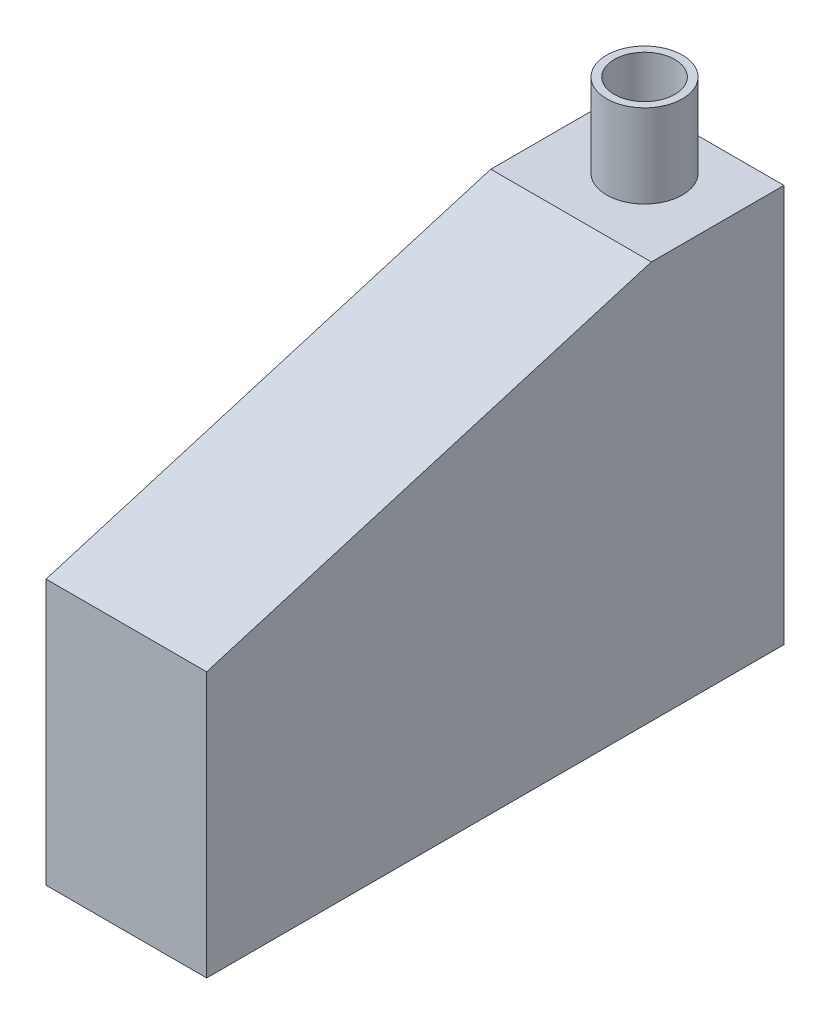
ISO-10303-21;
HEADER;
FILE_DESCRIPTION(('STEP AP214'),'2;1');
FILE_NAME('part.step','',(''),(''),'','','');
FILE_SCHEMA(('AUTOMOTIVE_DESIGN { 1 0 10303 214 1 1 1 1 }'));
ENDSEC;
DATA;
#1=APPLICATION_CONTEXT('core data for automotive mechanical design processes');
#2=APPLICATION_PROTOCOL_DEFINITION('international standard','automotive_design',2000,#1);
#3=PRODUCT_CONTEXT('',#1,'mechanical');
#4=PRODUCT('Part','Part','',(#3));
#5=PRODUCT_RELATED_PRODUCT_CATEGORY('part','',(#4));
#6=PRODUCT_DEFINITION_FORMATION('','',#4);
#7=PRODUCT_DEFINITION_CONTEXT('part definition',#1,'design');
#8=PRODUCT_DEFINITION('design','',#6,#7);
#9=PRODUCT_DEFINITION_SHAPE('','',#8);
#10=(LENGTH_UNIT() NAMED_UNIT(*) SI_UNIT(.MILLI.,.METRE.));
#11=(NAMED_UNIT(*) PLANE_ANGLE_UNIT() SI_UNIT($,.RADIAN.));
#12=(NAMED_UNIT(*) SI_UNIT($,.STERADIAN.) SOLID_ANGLE_UNIT());
#13=UNCERTAINTY_MEASURE_WITH_UNIT(LENGTH_MEASURE(1.E-05),#10,'distance_accuracy_value','');
#14=(GEOMETRIC_REPRESENTATION_CONTEXT(3) GLOBAL_UNCERTAINTY_ASSIGNED_CONTEXT((#13)) GLOBAL_UNIT_ASSIGNED_CONTEXT((#10,
#11,#12)) REPRESENTATION_CONTEXT('',''));
#15=CARTESIAN_POINT('',(0.,0.,0.));
#16=DIRECTION('',(0.,0.,1.));
#17=DIRECTION('',(1.,0.,0.));
#18=AXIS2_PLACEMENT_3D('',#15,#16,#17);
#19=CARTESIAN_POINT('',(0.,105.,0.));
#20=DIRECTION('',(0.,1.,0.));
#21=DIRECTION('',(0.,0.,1.));
#22=AXIS2_PLACEMENT_3D('',#19,#20,#21);
#23=PLANE('',#22);
#24=CARTESIAN_POINT('',(0.,105.,-60.5915110795934));
#25=DIRECTION('',(0.,1.,0.));
#26=DIRECTION('',(0.,0.,1.));
#27=AXIS2_PLACEMENT_3D('',#24,#25,#26);
#28=CIRCLE('',#27,8.);
#29=CARTESIAN_POINT('',(0.,105.,-52.5915110795934));
#30=VERTEX_POINT('',#29);
#31=EDGE_CURVE('E61',#30,#30,#28,.T.);
#32=ORIENTED_EDGE('',*,*,#31,.T.);
#33=EDGE_LOOP('',(#32));
#34=FACE_BOUND('',#33,.T.);
#35=CARTESIAN_POINT('',(0.,105.,-60.5915110795934));
#36=DIRECTION('',(0.,1.,0.));
#37=DIRECTION('',(0.,0.,1.));
#38=AXIS2_PLACEMENT_3D('',#35,#36,#37);
#39=CIRCLE('',#38,10.);
#40=CARTESIAN_POINT('',(0.,105.,-50.5915110795934));
#41=VERTEX_POINT('',#40);
#42=EDGE_CURVE('E51',#41,#41,#39,.T.);
#43=ORIENTED_EDGE('',*,*,#42,.F.);
#44=EDGE_LOOP('',(#43));
#45=FACE_BOUND('',#44,.T.);
#46=ADVANCED_FACE('F48',(#34,#45),#23,.F.);
#47=CARTESIAN_POINT('',(0.,127.,-60.5915110795934));
#48=DIRECTION('',(0.,-1.,0.));
#49=DIRECTION('',(0.,0.,-1.));
#50=AXIS2_PLACEMENT_3D('',#47,#48,#49);
#51=CYLINDRICAL_SURFACE('',#50,10.);
#52=CARTESIAN_POINT('',(0.,127.,-60.5915110795934));
#53=DIRECTION('',(0.,1.,0.));
#54=DIRECTION('',(0.,0.,1.));
#55=AXIS2_PLACEMENT_3D('',#52,#53,#54);
#56=CIRCLE('',#55,10.);
#57=CARTESIAN_POINT('',(0.,127.,-50.5915110795934));
#58=VERTEX_POINT('',#57);
#59=EDGE_CURVE('E55',#58,#58,#56,.T.);
#60=ORIENTED_EDGE('',*,*,#59,.F.);
#61=EDGE_LOOP('',(#60));
#62=FACE_BOUND('',#61,.T.);
#63=ORIENTED_EDGE('',*,*,#42,.T.);
#64=EDGE_LOOP('',(#63));
#65=FACE_BOUND('',#64,.T.);
#66=ADVANCED_FACE('F68',(#62,#65),#51,.T.);
#67=CARTESIAN_POINT('',(0.,127.,-60.5915110795934));
#68=DIRECTION('',(0.,1.,0.));
#69=DIRECTION('',(0.,0.,1.));
#70=AXIS2_PLACEMENT_3D('',#67,#68,#69);
#71=PLANE('',#70);
#72=ORIENTED_EDGE('',*,*,#59,.T.);
#73=EDGE_LOOP('',(#72));
#74=FACE_BOUND('',#73,.T.);
#75=CARTESIAN_POINT('',(0.,127.,-60.5915110795934));
#76=DIRECTION('',(0.,1.,0.));
#77=DIRECTION('',(0.,0.,1.));
#78=AXIS2_PLACEMENT_3D('',#75,#76,#77);
#79=CIRCLE('',#78,8.);
#80=CARTESIAN_POINT('',(0.,127.,-52.5915110795934));
#81=VERTEX_POINT('',#80);
#82=EDGE_CURVE('E11',#81,#81,#79,.T.);
#83=ORIENTED_EDGE('',*,*,#82,.F.);
#84=EDGE_LOOP('',(#83));
#85=FACE_BOUND('',#84,.T.);
#86=ADVANCED_FACE('F74',(#74,#85),#71,.T.);
#87=CARTESIAN_POINT('',(0.,127.,-60.5915110795934));
#88=DIRECTION('',(0.,-1.,0.));
#89=DIRECTION('',(0.,0.,-1.));
#90=AXIS2_PLACEMENT_3D('',#87,#88,#89);
#91=CYLINDRICAL_SURFACE('',#90,8.);
#92=ORIENTED_EDGE('',*,*,#82,.T.);
#93=EDGE_LOOP('',(#92));
#94=FACE_BOUND('',#93,.T.);
#95=ORIENTED_EDGE('',*,*,#31,.F.);
#96=EDGE_LOOP('',(#95));
#97=FACE_BOUND('',#96,.T.);
#98=ADVANCED_FACE('F80',(#94,#97),#91,.F.);
#99=CLOSED_SHELL('',(#46,#66,#86,#98));
#100=MANIFOLD_SOLID_BREP('B2',#99);
#101=CARTESIAN_POINT('',(177.567387904256,70.,-76.2));
#102=DIRECTION('',(0.,-1.,0.));
#103=DIRECTION('',(0.,0.,-1.));
#104=AXIS2_PLACEMENT_3D('',#101,#102,#103);
#105=PLANE('',#104);
#106=DIRECTION('',(-1.,0.,0.));
#107=VECTOR('',#106,1.);
#108=CARTESIAN_POINT('',(19.6,70.,71.9997886933622));
#109=LINE('',#108,#107);
#110=CARTESIAN_POINT('',(19.6,70.,71.9997886933622));
#111=VERTEX_POINT('',#110);
#112=CARTESIAN_POINT('',(-20.,70.,71.9997886933622));
#113=VERTEX_POINT('',#112);
#114=EDGE_CURVE('E247',#111,#113,#109,.T.);
#115=ORIENTED_EDGE('',*,*,#114,.F.);
#116=DIRECTION('',(0.,0.,-1.));
#117=VECTOR('',#116,1.);
#118=CARTESIAN_POINT('',(19.6,70.,0.));
#119=LINE('',#118,#117);
#120=CARTESIAN_POINT('',(19.6,70.,-75.));
#121=VERTEX_POINT('',#120);
#122=EDGE_CURVE('E274',#111,#121,#119,.T.);
#123=ORIENTED_EDGE('',*,*,#122,.T.);
#124=DIRECTION('',(-1.,0.,0.));
#125=VECTOR('',#124,1.);
#126=CARTESIAN_POINT('',(20.,70.,-75.));
#127=LINE('',#126,#125);
#128=CARTESIAN_POINT('',(20.,70.,-75.));
#129=VERTEX_POINT('',#128);
#130=EDGE_CURVE('E281',#129,#121,#127,.T.);
#131=ORIENTED_EDGE('',*,*,#130,.F.);
#132=DIRECTION('',(0.,0.,-1.));
#133=VECTOR('',#132,1.);
#134=CARTESIAN_POINT('',(20.,70.,75.));
#135=LINE('',#134,#133);
#136=CARTESIAN_POINT('',(20.,70.,75.));
#137=VERTEX_POINT('',#136);
#138=EDGE_CURVE('E301',#137,#129,#135,.T.);
#139=ORIENTED_EDGE('',*,*,#138,.F.);
#140=DIRECTION('',(1.,0.,0.));
#141=VECTOR('',#140,1.);
#142=CARTESIAN_POINT('',(20.,70.,75.));
#143=LINE('',#142,#141);
#144=CARTESIAN_POINT('',(-20.,70.,75.));
#145=VERTEX_POINT('',#144);
#146=EDGE_CURVE('E288',#145,#137,#143,.T.);
#147=ORIENTED_EDGE('',*,*,#146,.F.);
#148=DIRECTION('',(0.,0.,1.));
#149=VECTOR('',#148,1.);
#150=CARTESIAN_POINT('',(-20.,70.,75.));
#151=LINE('',#150,#149);
#152=EDGE_CURVE('E267',#113,#145,#151,.T.);
#153=ORIENTED_EDGE('',*,*,#152,.F.);
#154=EDGE_LOOP('',(#115,#123,#131,#139,#147,#153));
#155=FACE_BOUND('',#154,.T.);
#156=ADVANCED_FACE('F117',(#155),#105,.T.);
#157=CARTESIAN_POINT('',(0.,2.,0.));
#158=DIRECTION('',(0.,1.,0.));
#159=DIRECTION('',(0.,0.,1.));
#160=AXIS2_PLACEMENT_3D('',#157,#158,#159);
#161=PLANE('',#160);
#162=DIRECTION('',(0.,0.,-1.));
#163=VECTOR('',#162,1.);
#164=CARTESIAN_POINT('',(-20.,2.,0.));
#165=LINE('',#164,#163);
#166=CARTESIAN_POINT('',(-20.,2.,75.));
#167=VERTEX_POINT('',#166);
#168=CARTESIAN_POINT('',(-20.,2.,-75.));
#169=VERTEX_POINT('',#168);
#170=EDGE_CURVE('E240',#167,#169,#165,.T.);
#171=ORIENTED_EDGE('',*,*,#170,.F.);
#172=DIRECTION('',(-1.,0.,0.));
#173=VECTOR('',#172,1.);
#174=CARTESIAN_POINT('',(0.,2.,75.));
#175=LINE('',#174,#173);
#176=CARTESIAN_POINT('',(20.,2.,75.));
#177=VERTEX_POINT('',#176);
#178=EDGE_CURVE('E173',#177,#167,#175,.T.);
#179=ORIENTED_EDGE('',*,*,#178,.F.);
#180=DIRECTION('',(0.,0.,-1.));
#181=VECTOR('',#180,1.);
#182=CARTESIAN_POINT('',(20.,2.,0.));
#183=LINE('',#182,#181);
#184=CARTESIAN_POINT('',(20.,2.,-75.));
#185=VERTEX_POINT('',#184);
#186=EDGE_CURVE('E278',#177,#185,#183,.T.);
#187=ORIENTED_EDGE('',*,*,#186,.T.);
#188=DIRECTION('',(-1.,0.,0.));
#189=VECTOR('',#188,1.);
#190=CARTESIAN_POINT('',(0.,2.,-75.));
#191=LINE('',#190,#189);
#192=EDGE_CURVE('E309',#185,#169,#191,.T.);
#193=ORIENTED_EDGE('',*,*,#192,.T.);
#194=EDGE_LOOP('',(#171,#179,#187,#193));
#195=FACE_BOUND('',#194,.T.);
#196=ADVANCED_FACE('F327',(#195),#161,.T.);
#197=CARTESIAN_POINT('',(20.,70.,75.));
#198=DIRECTION('',(-1.,0.,0.));
#199=DIRECTION('',(0.,0.,1.));
#200=AXIS2_PLACEMENT_3D('',#197,#198,#199);
#201=PLANE('',#200);
#202=ORIENTED_EDGE('',*,*,#186,.F.);
#203=DIRECTION('',(0.,-1.,0.));
#204=VECTOR('',#203,1.);
#205=CARTESIAN_POINT('',(20.,70.,75.));
#206=LINE('',#205,#204);
#207=EDGE_CURVE('E284',#137,#177,#206,.T.);
#208=ORIENTED_EDGE('',*,*,#207,.F.);
#209=ORIENTED_EDGE('',*,*,#138,.T.);
#210=DIRECTION('',(0.,-1.,0.));
#211=VECTOR('',#210,1.);
#212=CARTESIAN_POINT('',(20.,70.,-75.));
#213=LINE('',#212,#211);
#214=EDGE_CURVE('E297',#129,#185,#213,.T.);
#215=ORIENTED_EDGE('',*,*,#214,.T.);
#216=EDGE_LOOP('',(#202,#208,#209,#215));
#217=FACE_BOUND('',#216,.T.);
#218=ADVANCED_FACE('F333',(#217),#201,.T.);
#219=CARTESIAN_POINT('',(20.,70.,-75.));
#220=DIRECTION('',(0.,0.,1.));
#221=DIRECTION('',(1.,0.,0.));
#222=AXIS2_PLACEMENT_3D('',#219,#220,#221);
#223=PLANE('',#222);
#224=ORIENTED_EDGE('',*,*,#192,.F.);
#225=ORIENTED_EDGE('',*,*,#214,.F.);
#226=ORIENTED_EDGE('',*,*,#130,.T.);
#227=DIRECTION('',(0.,1.,0.));
#228=VECTOR('',#227,1.);
#229=CARTESIAN_POINT('',(19.6,0.,-75.));
#230=LINE('',#229,#228);
#231=CARTESIAN_POINT('',(19.6,103.8,-75.));
#232=VERTEX_POINT('',#231);
#233=EDGE_CURVE('E260',#121,#232,#230,.T.);
#234=ORIENTED_EDGE('',*,*,#233,.T.);
#235=DIRECTION('',(-1.,0.,0.));
#236=VECTOR('',#235,1.);
#237=CARTESIAN_POINT('',(19.6,103.8,-75.));
#238=LINE('',#237,#236);
#239=CARTESIAN_POINT('',(-20.,103.8,-75.));
#240=VERTEX_POINT('',#239);
#241=EDGE_CURVE('E255',#232,#240,#238,.T.);
#242=ORIENTED_EDGE('',*,*,#241,.T.);
#243=DIRECTION('',(0.,-1.,0.));
#244=VECTOR('',#243,1.);
#245=CARTESIAN_POINT('',(-20.,70.,-75.));
#246=LINE('',#245,#244);
#247=EDGE_CURVE('E259',#240,#169,#246,.T.);
#248=ORIENTED_EDGE('',*,*,#247,.T.);
#249=EDGE_LOOP('',(#224,#225,#226,#234,#242,#248));
#250=FACE_BOUND('',#249,.T.);
#251=ADVANCED_FACE('F331',(#250),#223,.T.);
#252=CARTESIAN_POINT('',(-20.,70.,75.));
#253=DIRECTION('',(1.,0.,0.));
#254=DIRECTION('',(0.,0.,-1.));
#255=AXIS2_PLACEMENT_3D('',#252,#253,#254);
#256=PLANE('',#255);
#257=ORIENTED_EDGE('',*,*,#170,.T.);
#258=ORIENTED_EDGE('',*,*,#247,.F.);
#259=DIRECTION('',(0.,0.,1.));
#260=VECTOR('',#259,1.);
#261=CARTESIAN_POINT('',(-20.,103.8,0.));
#262=LINE('',#261,#260);
#263=CARTESIAN_POINT('',(-20.,103.8,-41.375068449495));
#264=VERTEX_POINT('',#263);
#265=EDGE_CURVE('E261',#240,#264,#262,.T.);
#266=ORIENTED_EDGE('',*,*,#265,.T.);
#267=DIRECTION('',(0.,-0.285699911836239,0.958319132844986));
#268=VECTOR('',#267,1.);
#269=CARTESIAN_POINT('',(-20.,83.9992331794369,25.0423608286226));
#270=LINE('',#269,#268);
#271=EDGE_CURVE('E264',#264,#113,#270,.T.);
#272=ORIENTED_EDGE('',*,*,#271,.T.);
#273=ORIENTED_EDGE('',*,*,#152,.T.);
#274=DIRECTION('',(0.,-1.,0.));
#275=VECTOR('',#274,1.);
#276=CARTESIAN_POINT('',(-20.,70.,75.));
#277=LINE('',#276,#275);
#278=EDGE_CURVE('E296',#145,#167,#277,.T.);
#279=ORIENTED_EDGE('',*,*,#278,.T.);
#280=EDGE_LOOP('',(#257,#258,#266,#272,#273,#279));
#281=FACE_BOUND('',#280,.T.);
#282=ADVANCED_FACE('F323',(#281),#256,.T.);
#283=CARTESIAN_POINT('',(20.,70.,75.));
#284=DIRECTION('',(0.,0.,-1.));
#285=DIRECTION('',(-1.,0.,0.));
#286=AXIS2_PLACEMENT_3D('',#283,#284,#285);
#287=PLANE('',#286);
#288=ORIENTED_EDGE('',*,*,#178,.T.);
#289=ORIENTED_EDGE('',*,*,#278,.F.);
#290=ORIENTED_EDGE('',*,*,#146,.T.);
#291=ORIENTED_EDGE('',*,*,#207,.T.);
#292=EDGE_LOOP('',(#288,#289,#290,#291));
#293=FACE_BOUND('',#292,.T.);
#294=ADVANCED_FACE('F336',(#293),#287,.T.);
#295=CARTESIAN_POINT('',(19.6,103.8,0.));
#296=DIRECTION('',(0.,-1.,0.));
#297=DIRECTION('',(0.,0.,-1.));
#298=AXIS2_PLACEMENT_3D('',#295,#296,#297);
#299=PLANE('',#298);
#300=CARTESIAN_POINT('',(0.,103.8,-60.5915110795934));
#301=DIRECTION('',(0.,-1.,0.));
#302=DIRECTION('',(0.,0.,-1.));
#303=AXIS2_PLACEMENT_3D('',#300,#301,#302);
#304=CIRCLE('',#303,10.);
#305=CARTESIAN_POINT('',(0.,103.8,-70.5915110795934));
#306=VERTEX_POINT('',#305);
#307=EDGE_CURVE('E270',#306,#306,#304,.F.);
#308=ORIENTED_EDGE('',*,*,#307,.T.);
#309=EDGE_LOOP('',(#308));
#310=FACE_BOUND('',#309,.T.);
#311=ORIENTED_EDGE('',*,*,#265,.F.);
#312=ORIENTED_EDGE('',*,*,#241,.F.);
#313=DIRECTION('',(0.,0.,1.));
#314=VECTOR('',#313,1.);
#315=CARTESIAN_POINT('',(19.6,103.8,0.));
#316=LINE('',#315,#314);
#317=CARTESIAN_POINT('',(19.6,103.8,-41.375068449495));
#318=VERTEX_POINT('',#317);
#319=EDGE_CURVE('E164',#232,#318,#316,.T.);
#320=ORIENTED_EDGE('',*,*,#319,.T.);
#321=DIRECTION('',(-1.,0.,0.));
#322=VECTOR('',#321,1.);
#323=CARTESIAN_POINT('',(19.6,103.8,-41.375068449495));
#324=LINE('',#323,#322);
#325=EDGE_CURVE('E252',#318,#264,#324,.T.);
#326=ORIENTED_EDGE('',*,*,#325,.T.);
#327=EDGE_LOOP('',(#311,#312,#320,#326));
#328=FACE_BOUND('',#327,.T.);
#329=ADVANCED_FACE('F338',(#310,#328),#299,.T.);
#330=CARTESIAN_POINT('',(19.6,83.9992331794369,25.0423608286226));
#331=DIRECTION('',(0.,-0.958319132844986,-0.285699911836239));
#332=DIRECTION('',(0.,0.285699911836239,-0.958319132844986));
#333=AXIS2_PLACEMENT_3D('',#330,#331,#332);
#334=PLANE('',#333);
#335=ORIENTED_EDGE('',*,*,#271,.F.);
#336=ORIENTED_EDGE('',*,*,#325,.F.);
#337=DIRECTION('',(0.,-0.285699911836239,0.958319132844986));
#338=VECTOR('',#337,1.);
#339=CARTESIAN_POINT('',(19.6,83.9992331794369,25.0423608286226));
#340=LINE('',#339,#338);
#341=EDGE_CURVE('E251',#318,#111,#340,.T.);
#342=ORIENTED_EDGE('',*,*,#341,.T.);
#343=ORIENTED_EDGE('',*,*,#114,.T.);
#344=EDGE_LOOP('',(#335,#336,#342,#343));
#345=FACE_BOUND('',#344,.T.);
#346=ADVANCED_FACE('F344',(#345),#334,.T.);
#347=CARTESIAN_POINT('',(19.6,0.,0.));
#348=DIRECTION('',(-1.,0.,0.));
#349=DIRECTION('',(0.,0.,1.));
#350=AXIS2_PLACEMENT_3D('',#347,#348,#349);
#351=PLANE('',#350);
#352=ORIENTED_EDGE('',*,*,#233,.F.);
#353=ORIENTED_EDGE('',*,*,#122,.F.);
#354=ORIENTED_EDGE('',*,*,#341,.F.);
#355=ORIENTED_EDGE('',*,*,#319,.F.);
#356=EDGE_LOOP('',(#352,#353,#354,#355));
#357=FACE_BOUND('',#356,.T.);
#358=ADVANCED_FACE('F360',(#357),#351,.T.);
#359=CARTESIAN_POINT('',(0.,-0.001000000000001,-60.5915110795934));
#360=DIRECTION('',(0.,1.,0.));
#361=DIRECTION('',(0.,0.,1.));
#362=AXIS2_PLACEMENT_3D('',#359,#360,#361);
#363=CYLINDRICAL_SURFACE('',#362,10.);
#364=ORIENTED_EDGE('',*,*,#307,.F.);
#365=EDGE_LOOP('',(#364));
#366=FACE_BOUND('',#365,.T.);
#367=CARTESIAN_POINT('',(0.,105.,-60.5915110795934));
#368=DIRECTION('',(0.,1.,0.));
#369=DIRECTION('',(0.,0.,1.));
#370=AXIS2_PLACEMENT_3D('',#367,#368,#369);
#371=CIRCLE('',#370,10.);
#372=CARTESIAN_POINT('',(0.,105.,-50.5915110795934));
#373=VERTEX_POINT('',#372);
#374=EDGE_CURVE('E121',#373,#373,#371,.T.);
#375=ORIENTED_EDGE('',*,*,#374,.T.);
#376=EDGE_LOOP('',(#375));
#377=FACE_BOUND('',#376,.T.);
#378=ADVANCED_FACE('F364',(#366,#377),#363,.F.);
#379=CARTESIAN_POINT('',(0.,0.,0.));
#380=DIRECTION('',(0.,1.,0.));
#381=DIRECTION('',(0.,0.,1.));
#382=AXIS2_PLACEMENT_3D('',#379,#380,#381);
#383=PLANE('',#382);
#384=DIRECTION('',(0.,0.,1.));
#385=VECTOR('',#384,1.);
#386=CARTESIAN_POINT('',(-21.2,0.,76.2));
#387=LINE('',#386,#385);
#388=CARTESIAN_POINT('',(-21.2,0.,-76.2));
#389=VERTEX_POINT('',#388);
#390=CARTESIAN_POINT('',(-21.2,0.,76.2));
#391=VERTEX_POINT('',#390);
#392=EDGE_CURVE('E380',#389,#391,#387,.T.);
#393=ORIENTED_EDGE('',*,*,#392,.F.);
#394=DIRECTION('',(-1.,0.,0.));
#395=VECTOR('',#394,1.);
#396=CARTESIAN_POINT('',(21.2,0.,-76.2));
#397=LINE('',#396,#395);
#398=CARTESIAN_POINT('',(21.2,0.,-76.2));
#399=VERTEX_POINT('',#398);
#400=EDGE_CURVE('E400',#399,#389,#397,.T.);
#401=ORIENTED_EDGE('',*,*,#400,.F.);
#402=DIRECTION('',(0.,0.,-1.));
#403=VECTOR('',#402,1.);
#404=CARTESIAN_POINT('',(21.2,0.,76.2000000000001));
#405=LINE('',#404,#403);
#406=CARTESIAN_POINT('',(21.2,0.,76.2000000000001));
#407=VERTEX_POINT('',#406);
#408=EDGE_CURVE('E396',#407,#399,#405,.T.);
#409=ORIENTED_EDGE('',*,*,#408,.F.);
#410=DIRECTION('',(1.,0.,0.));
#411=VECTOR('',#410,1.);
#412=CARTESIAN_POINT('',(21.2,0.,76.2000000000001));
#413=LINE('',#412,#411);
#414=EDGE_CURVE('E390',#391,#407,#413,.T.);
#415=ORIENTED_EDGE('',*,*,#414,.F.);
#416=EDGE_LOOP('',(#393,#401,#409,#415));
#417=FACE_BOUND('',#416,.T.);
#418=ADVANCED_FACE('F367',(#417),#383,.F.);
#419=CARTESIAN_POINT('',(-21.2,70.,76.2));
#420=DIRECTION('',(1.,0.,0.));
#421=DIRECTION('',(0.,0.,-1.));
#422=AXIS2_PLACEMENT_3D('',#419,#420,#421);
#423=PLANE('',#422);
#424=ORIENTED_EDGE('',*,*,#392,.T.);
#425=DIRECTION('',(0.,-1.,0.));
#426=VECTOR('',#425,1.);
#427=CARTESIAN_POINT('',(-21.2,70.,76.2));
#428=LINE('',#427,#426);
#429=CARTESIAN_POINT('',(-21.2,70.,76.2));
#430=VERTEX_POINT('',#429);
#431=EDGE_CURVE('E395',#430,#391,#428,.T.);
#432=ORIENTED_EDGE('',*,*,#431,.F.);
#433=DIRECTION('',(0.,-0.285699911836239,0.958319132844986));
#434=VECTOR('',#433,1.);
#435=CARTESIAN_POINT('',(-21.2,105.,-41.2));
#436=LINE('',#435,#434);
#437=CARTESIAN_POINT('',(-21.2,105.,-41.2));
#438=VERTEX_POINT('',#437);
#439=EDGE_CURVE('E227',#438,#430,#436,.T.);
#440=ORIENTED_EDGE('',*,*,#439,.F.);
#441=DIRECTION('',(0.,0.,1.));
#442=VECTOR('',#441,1.);
#443=CARTESIAN_POINT('',(-21.2,105.,-76.2));
#444=LINE('',#443,#442);
#445=CARTESIAN_POINT('',(-21.2,105.,-76.2));
#446=VERTEX_POINT('',#445);
#447=EDGE_CURVE('E46',#446,#438,#444,.T.);
#448=ORIENTED_EDGE('',*,*,#447,.F.);
#449=DIRECTION('',(0.,-1.,0.));
#450=VECTOR('',#449,1.);
#451=CARTESIAN_POINT('',(-21.2,70.,-76.2));
#452=LINE('',#451,#450);
#453=EDGE_CURVE('E383',#446,#389,#452,.T.);
#454=ORIENTED_EDGE('',*,*,#453,.T.);
#455=EDGE_LOOP('',(#424,#432,#440,#448,#454));
#456=FACE_BOUND('',#455,.T.);
#457=ADVANCED_FACE('F372',(#456),#423,.F.);
#458=CARTESIAN_POINT('',(21.2,70.,76.2000000000001));
#459=DIRECTION('',(0.,0.,-1.));
#460=DIRECTION('',(-1.,0.,0.));
#461=AXIS2_PLACEMENT_3D('',#458,#459,#460);
#462=PLANE('',#461);
#463=ORIENTED_EDGE('',*,*,#414,.T.);
#464=DIRECTION('',(0.,-1.,0.));
#465=VECTOR('',#464,1.);
#466=CARTESIAN_POINT('',(21.2,70.,76.2000000000001));
#467=LINE('',#466,#465);
#468=CARTESIAN_POINT('',(21.2,70.,76.2000000000001));
#469=VERTEX_POINT('',#468);
#470=EDGE_CURVE('E399',#469,#407,#467,.T.);
#471=ORIENTED_EDGE('',*,*,#470,.F.);
#472=DIRECTION('',(1.,0.,0.));
#473=VECTOR('',#472,1.);
#474=CARTESIAN_POINT('',(21.2,70.,76.2000000000001));
#475=LINE('',#474,#473);
#476=EDGE_CURVE('E234',#430,#469,#475,.T.);
#477=ORIENTED_EDGE('',*,*,#476,.F.);
#478=ORIENTED_EDGE('',*,*,#431,.T.);
#479=EDGE_LOOP('',(#463,#471,#477,#478));
#480=FACE_BOUND('',#479,.T.);
#481=ADVANCED_FACE('F410',(#480),#462,.F.);
#482=CARTESIAN_POINT('',(21.2,70.,76.2000000000001));
#483=DIRECTION('',(-1.,0.,0.));
#484=DIRECTION('',(0.,0.,1.));
#485=AXIS2_PLACEMENT_3D('',#482,#483,#484);
#486=PLANE('',#485);
#487=ORIENTED_EDGE('',*,*,#408,.T.);
#488=DIRECTION('',(0.,-1.,0.));
#489=VECTOR('',#488,1.);
#490=CARTESIAN_POINT('',(21.2,70.,-76.2));
#491=LINE('',#490,#489);
#492=CARTESIAN_POINT('',(21.2,105.,-76.2));
#493=VERTEX_POINT('',#492);
#494=EDGE_CURVE('E222',#493,#399,#491,.T.);
#495=ORIENTED_EDGE('',*,*,#494,.F.);
#496=DIRECTION('',(0.,0.,-1.));
#497=VECTOR('',#496,1.);
#498=CARTESIAN_POINT('',(21.2,105.,-76.2));
#499=LINE('',#498,#497);
#500=CARTESIAN_POINT('',(21.2,105.,-41.2));
#501=VERTEX_POINT('',#500);
#502=EDGE_CURVE('E216',#501,#493,#499,.T.);
#503=ORIENTED_EDGE('',*,*,#502,.F.);
#504=DIRECTION('',(0.,0.285699911836239,-0.958319132844986));
#505=VECTOR('',#504,1.);
#506=CARTESIAN_POINT('',(21.2,105.,-41.2));
#507=LINE('',#506,#505);
#508=EDGE_CURVE('E219',#469,#501,#507,.T.);
#509=ORIENTED_EDGE('',*,*,#508,.F.);
#510=ORIENTED_EDGE('',*,*,#470,.T.);
#511=EDGE_LOOP('',(#487,#495,#503,#509,#510));
#512=FACE_BOUND('',#511,.T.);
#513=ADVANCED_FACE('F217',(#512),#486,.F.);
#514=CARTESIAN_POINT('',(21.2,70.,-76.2));
#515=DIRECTION('',(0.,0.,1.));
#516=DIRECTION('',(1.,0.,0.));
#517=AXIS2_PLACEMENT_3D('',#514,#515,#516);
#518=PLANE('',#517);
#519=ORIENTED_EDGE('',*,*,#400,.T.);
#520=ORIENTED_EDGE('',*,*,#453,.F.);
#521=DIRECTION('',(-1.,0.,0.));
#522=VECTOR('',#521,1.);
#523=CARTESIAN_POINT('',(177.567387904256,105.,-76.2));
#524=LINE('',#523,#522);
#525=EDGE_CURVE('E128',#493,#446,#524,.T.);
#526=ORIENTED_EDGE('',*,*,#525,.F.);
#527=ORIENTED_EDGE('',*,*,#494,.T.);
#528=EDGE_LOOP('',(#519,#520,#526,#527));
#529=FACE_BOUND('',#528,.T.);
#530=ADVANCED_FACE('F357',(#529),#518,.F.);
#531=CARTESIAN_POINT('',(177.567387904256,105.,-41.2));
#532=DIRECTION('',(0.,-0.958319132844986,-0.285699911836239));
#533=DIRECTION('',(0.,0.285699911836239,-0.958319132844986));
#534=AXIS2_PLACEMENT_3D('',#531,#532,#533);
#535=PLANE('',#534);
#536=ORIENTED_EDGE('',*,*,#476,.T.);
#537=ORIENTED_EDGE('',*,*,#508,.T.);
#538=DIRECTION('',(-1.,0.,0.));
#539=VECTOR('',#538,1.);
#540=CARTESIAN_POINT('',(177.567387904256,105.,-41.2));
#541=LINE('',#540,#539);
#542=EDGE_CURVE('E137',#501,#438,#541,.T.);
#543=ORIENTED_EDGE('',*,*,#542,.T.);
#544=ORIENTED_EDGE('',*,*,#439,.T.);
#545=EDGE_LOOP('',(#536,#537,#543,#544));
#546=FACE_BOUND('',#545,.T.);
#547=ADVANCED_FACE('F233',(#546),#535,.F.);
#548=CARTESIAN_POINT('',(177.567387904256,105.,-76.2));
#549=DIRECTION('',(0.,-1.,0.));
#550=DIRECTION('',(0.,0.,-1.));
#551=AXIS2_PLACEMENT_3D('',#548,#549,#550);
#552=PLANE('',#551);
#553=ORIENTED_EDGE('',*,*,#374,.F.);
#554=EDGE_LOOP('',(#553));
#555=FACE_BOUND('',#554,.T.);
#556=ORIENTED_EDGE('',*,*,#542,.F.);
#557=ORIENTED_EDGE('',*,*,#502,.T.);
#558=ORIENTED_EDGE('',*,*,#525,.T.);
#559=ORIENTED_EDGE('',*,*,#447,.T.);
#560=EDGE_LOOP('',(#556,#557,#558,#559));
#561=FACE_BOUND('',#560,.T.);
#562=ADVANCED_FACE('F119',(#555,#561),#552,.F.);
#563=CLOSED_SHELL('',(#156,#196,#218,#251,#282,#294,#329,#346,#358,#378,#418,#457,#481,#513,
#530,#547,#562));
#564=MANIFOLD_SOLID_BREP('B6',#563);
#565=CARTESIAN_POINT('',(19.6,103.8,0.));
#566=DIRECTION('',(0.,-1.,0.));
#567=DIRECTION('',(0.,0.,-1.));
#568=AXIS2_PLACEMENT_3D('',#565,#566,#567);
#569=PLANE('',#568);
#570=CARTESIAN_POINT('',(0.,103.8,-60.5915110795934));
#571=DIRECTION('',(0.,-1.,0.));
#572=DIRECTION('',(0.,0.,-1.));
#573=AXIS2_PLACEMENT_3D('',#570,#571,#572);
#574=CIRCLE('',#573,8.);
#575=CARTESIAN_POINT('',(0.,103.8,-68.5915110795934));
#576=VERTEX_POINT('',#575);
#577=EDGE_CURVE('E116',#576,#576,#574,.F.);
#578=ORIENTED_EDGE('',*,*,#577,.F.);
#579=EDGE_LOOP('',(#578));
#580=FACE_BOUND('',#579,.T.);
#581=ADVANCED_FACE('F546',(#580),#569,.T.);
#582=CARTESIAN_POINT('',(0.,-0.001000000000001,-60.5915110795934));
#583=DIRECTION('',(0.,1.,0.));
#584=DIRECTION('',(0.,0.,1.));
#585=AXIS2_PLACEMENT_3D('',#582,#583,#584);
#586=CYLINDRICAL_SURFACE('',#585,8.);
#587=ORIENTED_EDGE('',*,*,#577,.T.);
#588=EDGE_LOOP('',(#587));
#589=FACE_BOUND('',#588,.T.);
#590=CARTESIAN_POINT('',(0.,105.,-60.5915110795934));
#591=DIRECTION('',(0.,1.,0.));
#592=DIRECTION('',(0.,0.,1.));
#593=AXIS2_PLACEMENT_3D('',#590,#591,#592);
#594=CIRCLE('',#593,8.);
#595=CARTESIAN_POINT('',(0.,105.,-52.5915110795934));
#596=VERTEX_POINT('',#595);
#597=EDGE_CURVE('E553',#596,#596,#594,.T.);
#598=ORIENTED_EDGE('',*,*,#597,.F.);
#599=EDGE_LOOP('',(#598));
#600=FACE_BOUND('',#599,.T.);
#601=ADVANCED_FACE('F560',(#589,#600),#586,.T.);
#602=CARTESIAN_POINT('',(177.567387904256,105.,-76.2));
#603=DIRECTION('',(0.,-1.,0.));
#604=DIRECTION('',(0.,0.,-1.));
#605=AXIS2_PLACEMENT_3D('',#602,#603,#604);
#606=PLANE('',#605);
#607=ORIENTED_EDGE('',*,*,#597,.T.);
#608=EDGE_LOOP('',(#607));
#609=FACE_BOUND('',#608,.T.);
#610=ADVANCED_FACE('F548',(#609),#606,.F.);
#611=CLOSED_SHELL('',(#581,#601,#610));
#612=MANIFOLD_SOLID_BREP('B40',#611);
#613=ADVANCED_BREP_SHAPE_REPRESENTATION('',(#18,#100,#564,#612),#14);
#614=SHAPE_DEFINITION_REPRESENTATION(#9,#613);
ENDSEC;
END-ISO-10303-21;
